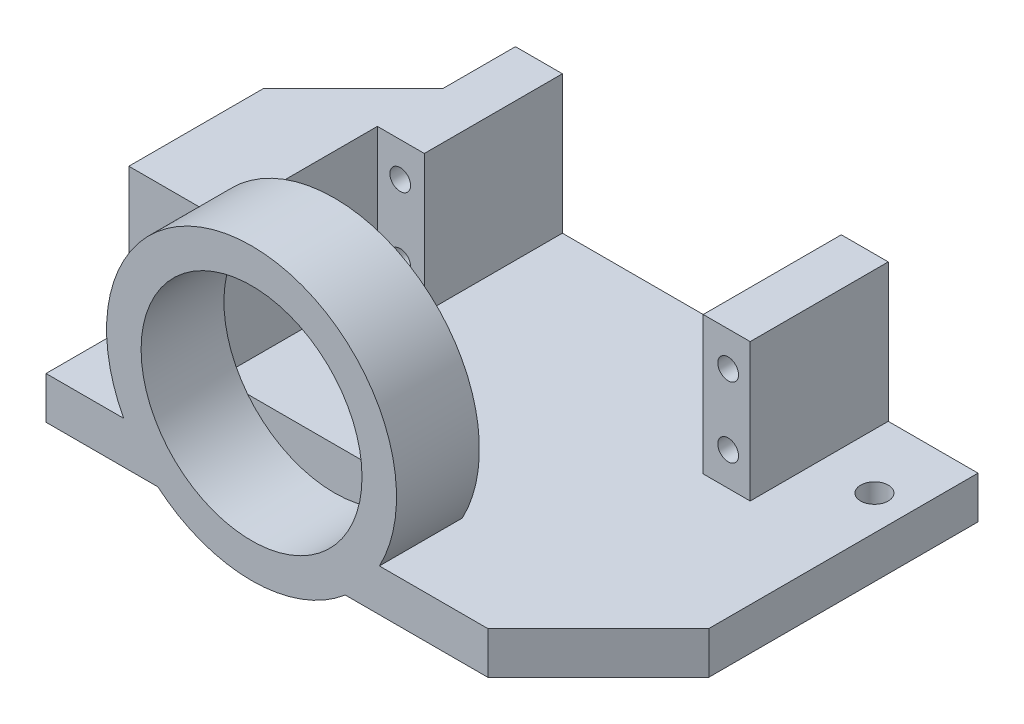
ISO-10303-21;
HEADER;
FILE_DESCRIPTION(('STEP AP214'),'2;1');
FILE_NAME('part.step','',(''),(''),'','','');
FILE_SCHEMA(('AUTOMOTIVE_DESIGN { 1 0 10303 214 1 1 1 1 }'));
ENDSEC;
DATA;
#1=APPLICATION_CONTEXT('core data for automotive mechanical design processes');
#2=APPLICATION_PROTOCOL_DEFINITION('international standard','automotive_design',2000,#1);
#3=PRODUCT_CONTEXT('',#1,'mechanical');
#4=PRODUCT('Part','Part','',(#3));
#5=PRODUCT_RELATED_PRODUCT_CATEGORY('part','',(#4));
#6=PRODUCT_DEFINITION_FORMATION('','',#4);
#7=PRODUCT_DEFINITION_CONTEXT('part definition',#1,'design');
#8=PRODUCT_DEFINITION('design','',#6,#7);
#9=PRODUCT_DEFINITION_SHAPE('','',#8);
#10=(LENGTH_UNIT() NAMED_UNIT(*) SI_UNIT(.MILLI.,.METRE.));
#11=(NAMED_UNIT(*) PLANE_ANGLE_UNIT() SI_UNIT($,.RADIAN.));
#12=(NAMED_UNIT(*) SI_UNIT($,.STERADIAN.) SOLID_ANGLE_UNIT());
#13=UNCERTAINTY_MEASURE_WITH_UNIT(LENGTH_MEASURE(1.E-05),#10,'distance_accuracy_value','');
#14=(GEOMETRIC_REPRESENTATION_CONTEXT(3) GLOBAL_UNCERTAINTY_ASSIGNED_CONTEXT((#13)) GLOBAL_UNIT_ASSIGNED_CONTEXT((#10,
#11,#12)) REPRESENTATION_CONTEXT('',''));
#15=CARTESIAN_POINT('',(0.,0.,0.));
#16=DIRECTION('',(0.,0.,1.));
#17=DIRECTION('',(1.,0.,0.));
#18=AXIS2_PLACEMENT_3D('',#15,#16,#17);
#19=CARTESIAN_POINT('',(0.,6.12,0.));
#20=DIRECTION('',(0.,-1.,0.));
#21=DIRECTION('',(0.,0.,-1.));
#22=AXIS2_PLACEMENT_3D('',#19,#20,#21);
#23=PLANE('',#22);
#24=CARTESIAN_POINT('',(5.,6.12,-10.));
#25=DIRECTION('',(0.,1.,0.));
#26=DIRECTION('',(0.,0.,1.));
#27=AXIS2_PLACEMENT_3D('',#24,#25,#26);
#28=CIRCLE('',#27,2.);
#29=CARTESIAN_POINT('',(5.,6.12,-8.));
#30=VERTEX_POINT('',#29);
#31=EDGE_CURVE('E232',#30,#30,#28,.T.);
#32=ORIENTED_EDGE('',*,*,#31,.F.);
#33=EDGE_LOOP('',(#32));
#34=FACE_BOUND('',#33,.T.);
#35=DIRECTION('',(0.,0.,1.));
#36=VECTOR('',#35,1.);
#37=CARTESIAN_POINT('',(0.,6.12,0.));
#38=LINE('',#37,#36);
#39=CARTESIAN_POINT('',(0.,6.12,-20.));
#40=VERTEX_POINT('',#39);
#41=CARTESIAN_POINT('',(0.,6.12,3.50000000000001));
#42=VERTEX_POINT('',#41);
#43=EDGE_CURVE('E224',#40,#42,#38,.T.);
#44=ORIENTED_EDGE('',*,*,#43,.T.);
#45=DIRECTION('',(-0.707106781186549,0.,0.707106781186546));
#46=VECTOR('',#45,1.);
#47=CARTESIAN_POINT('',(1.75,6.12,1.75000000000001));
#48=LINE('',#47,#46);
#49=CARTESIAN_POINT('',(6.49999999999997,6.12,-3.));
#50=VERTEX_POINT('',#49);
#51=EDGE_CURVE('E51',#42,#50,#48,.F.);
#52=ORIENTED_EDGE('',*,*,#51,.T.);
#53=DIRECTION('',(-0.707106781186551,0.,0.707106781186544));
#54=VECTOR('',#53,1.);
#55=CARTESIAN_POINT('',(6.49999999999997,6.12,-3.));
#56=LINE('',#55,#54);
#57=CARTESIAN_POINT('',(13.,6.12,-9.49999999999996));
#58=VERTEX_POINT('',#57);
#59=EDGE_CURVE('E58',#50,#58,#56,.F.);
#60=ORIENTED_EDGE('',*,*,#59,.T.);
#61=DIRECTION('',(0.,0.,1.));
#62=VECTOR('',#61,1.);
#63=CARTESIAN_POINT('',(13.,6.12,0.));
#64=LINE('',#63,#62);
#65=CARTESIAN_POINT('',(13.,6.12,-20.));
#66=VERTEX_POINT('',#65);
#67=EDGE_CURVE('E280',#66,#58,#64,.T.);
#68=ORIENTED_EDGE('',*,*,#67,.F.);
#69=DIRECTION('',(-1.,0.,0.));
#70=VECTOR('',#69,1.);
#71=CARTESIAN_POINT('',(0.,6.12,-20.));
#72=LINE('',#71,#70);
#73=EDGE_CURVE('E235',#66,#40,#72,.T.);
#74=ORIENTED_EDGE('',*,*,#73,.T.);
#75=EDGE_LOOP('',(#44,#52,#60,#68,#74));
#76=FACE_BOUND('',#75,.T.);
#77=ADVANCED_FACE('F41',(#34,#76),#23,.F.);
#78=DIRECTION('',(0.,0.,1.));
#79=VECTOR('',#78,1.);
#80=CARTESIAN_POINT('',(11.2572193942898,6.12,23.));
#81=LINE('',#80,#79);
#82=CARTESIAN_POINT('',(11.2572193942898,6.12,35.));
#83=VERTEX_POINT('',#82);
#84=CARTESIAN_POINT('',(11.2572193942898,6.12,23.));
#85=VERTEX_POINT('',#84);
#86=EDGE_CURVE('E217',#83,#85,#81,.F.);
#87=ORIENTED_EDGE('',*,*,#86,.T.);
#88=DIRECTION('',(-1.,0.,0.));
#89=VECTOR('',#88,1.);
#90=CARTESIAN_POINT('',(13.,6.12,23.));
#91=LINE('',#90,#89);
#92=CARTESIAN_POINT('',(0.,6.12,23.));
#93=VERTEX_POINT('',#92);
#94=EDGE_CURVE('E200',#85,#93,#91,.T.);
#95=ORIENTED_EDGE('',*,*,#94,.T.);
#96=CARTESIAN_POINT('',(0.,6.12,35.));
#97=VERTEX_POINT('',#96);
#98=EDGE_CURVE('E214',#93,#97,#38,.T.);
#99=ORIENTED_EDGE('',*,*,#98,.T.);
#100=DIRECTION('',(-1.,0.,0.));
#101=VECTOR('',#100,1.);
#102=CARTESIAN_POINT('',(0.,6.12,35.));
#103=LINE('',#102,#101);
#104=EDGE_CURVE('E391',#83,#97,#103,.T.);
#105=ORIENTED_EDGE('',*,*,#104,.F.);
#106=EDGE_LOOP('',(#87,#95,#99,#105));
#107=FACE_BOUND('',#106,.T.);
#108=ADVANCED_FACE('F212',(#107),#23,.F.);
#109=CARTESIAN_POINT('',(13.,26.12,0.));
#110=DIRECTION('',(1.,0.,0.));
#111=DIRECTION('',(0.,0.,-1.));
#112=AXIS2_PLACEMENT_3D('',#109,#110,#111);
#113=PLANE('',#112);
#114=ORIENTED_EDGE('',*,*,#67,.T.);
#115=DIRECTION('',(0.,1.,0.));
#116=VECTOR('',#115,1.);
#117=CARTESIAN_POINT('',(13.,26.12,-9.49999999999996));
#118=LINE('',#117,#116);
#119=CARTESIAN_POINT('',(13.,26.12,-9.49999999999996));
#120=VERTEX_POINT('',#119);
#121=EDGE_CURVE('E271',#58,#120,#118,.T.);
#122=ORIENTED_EDGE('',*,*,#121,.T.);
#123=DIRECTION('',(0.,0.,1.));
#124=VECTOR('',#123,1.);
#125=CARTESIAN_POINT('',(13.,26.12,0.));
#126=LINE('',#125,#124);
#127=CARTESIAN_POINT('',(13.,26.12,-20.));
#128=VERTEX_POINT('',#127);
#129=EDGE_CURVE('E279',#128,#120,#126,.T.);
#130=ORIENTED_EDGE('',*,*,#129,.F.);
#131=DIRECTION('',(0.,-1.,0.));
#132=VECTOR('',#131,1.);
#133=CARTESIAN_POINT('',(13.,26.12,-20.));
#134=LINE('',#133,#132);
#135=EDGE_CURVE('E415',#128,#66,#134,.T.);
#136=ORIENTED_EDGE('',*,*,#135,.T.);
#137=EDGE_LOOP('',(#114,#122,#130,#136));
#138=FACE_BOUND('',#137,.T.);
#139=ADVANCED_FACE('F277',(#138),#113,.F.);
#140=CARTESIAN_POINT('',(0.,6.12,0.));
#141=DIRECTION('',(0.,0.,-1.));
#142=DIRECTION('',(-1.,0.,0.));
#143=AXIS2_PLACEMENT_3D('',#140,#141,#142);
#144=PLANE('',#143);
#145=CARTESIAN_POINT('',(63.81,10.946,0.));
#146=DIRECTION('',(0.,0.,1.));
#147=DIRECTION('',(1.,0.,0.));
#148=AXIS2_PLACEMENT_3D('',#145,#146,#147);
#149=CIRCLE('',#148,1.5);
#150=CARTESIAN_POINT('',(65.31,10.946,0.));
#151=VERTEX_POINT('',#150);
#152=EDGE_CURVE('E345',#151,#151,#149,.T.);
#153=ORIENTED_EDGE('',*,*,#152,.F.);
#154=EDGE_LOOP('',(#153));
#155=FACE_BOUND('',#154,.T.);
#156=CARTESIAN_POINT('',(63.81,21.106,0.));
#157=DIRECTION('',(0.,0.,1.));
#158=DIRECTION('',(1.,0.,0.));
#159=AXIS2_PLACEMENT_3D('',#156,#157,#158);
#160=CIRCLE('',#159,1.5);
#161=CARTESIAN_POINT('',(65.31,21.106,0.));
#162=VERTEX_POINT('',#161);
#163=EDGE_CURVE('E334',#162,#162,#160,.T.);
#164=ORIENTED_EDGE('',*,*,#163,.F.);
#165=EDGE_LOOP('',(#164));
#166=FACE_BOUND('',#165,.T.);
#167=DIRECTION('',(0.,1.,0.));
#168=VECTOR('',#167,1.);
#169=CARTESIAN_POINT('',(60.2,-38.9594853564235,0.));
#170=LINE('',#169,#168);
#171=CARTESIAN_POINT('',(60.2,6.12,0.));
#172=VERTEX_POINT('',#171);
#173=CARTESIAN_POINT('',(60.2,26.12,0.));
#174=VERTEX_POINT('',#173);
#175=EDGE_CURVE('E323',#172,#174,#170,.T.);
#176=ORIENTED_EDGE('',*,*,#175,.F.);
#177=DIRECTION('',(-1.,0.,0.));
#178=VECTOR('',#177,1.);
#179=CARTESIAN_POINT('',(0.,6.12,0.));
#180=LINE('',#179,#178);
#181=CARTESIAN_POINT('',(67.,6.12,0.));
#182=VERTEX_POINT('',#181);
#183=EDGE_CURVE('E260',#182,#172,#180,.T.);
#184=ORIENTED_EDGE('',*,*,#183,.F.);
#185=DIRECTION('',(0.,-1.,0.));
#186=VECTOR('',#185,1.);
#187=CARTESIAN_POINT('',(67.,26.12,0.));
#188=LINE('',#187,#186);
#189=CARTESIAN_POINT('',(67.,26.12,0.));
#190=VERTEX_POINT('',#189);
#191=EDGE_CURVE('E409',#190,#182,#188,.T.);
#192=ORIENTED_EDGE('',*,*,#191,.F.);
#193=DIRECTION('',(1.,0.,0.));
#194=VECTOR('',#193,1.);
#195=CARTESIAN_POINT('',(60.,26.12,0.));
#196=LINE('',#195,#194);
#197=EDGE_CURVE('E397',#174,#190,#196,.T.);
#198=ORIENTED_EDGE('',*,*,#197,.F.);
#199=EDGE_LOOP('',(#176,#184,#192,#198));
#200=FACE_BOUND('',#199,.T.);
#201=ADVANCED_FACE('F553',(#155,#166,#200),#144,.F.);
#202=CARTESIAN_POINT('',(0.,26.12,0.));
#203=DIRECTION('',(0.,-1.,0.));
#204=DIRECTION('',(0.,0.,-1.));
#205=AXIS2_PLACEMENT_3D('',#202,#203,#204);
#206=PLANE('',#205);
#207=DIRECTION('',(0.,0.,1.));
#208=VECTOR('',#207,1.);
#209=CARTESIAN_POINT('',(60.2,26.12,-20.));
#210=LINE('',#209,#208);
#211=CARTESIAN_POINT('',(60.2,26.12,-20.));
#212=VERTEX_POINT('',#211);
#213=EDGE_CURVE('E312',#212,#174,#210,.T.);
#214=ORIENTED_EDGE('',*,*,#213,.T.);
#215=ORIENTED_EDGE('',*,*,#197,.T.);
#216=DIRECTION('',(0.,0.,-1.));
#217=VECTOR('',#216,1.);
#218=CARTESIAN_POINT('',(67.,26.12,0.));
#219=LINE('',#218,#217);
#220=CARTESIAN_POINT('',(67.,26.12,-20.));
#221=VERTEX_POINT('',#220);
#222=EDGE_CURVE('E399',#190,#221,#219,.T.);
#223=ORIENTED_EDGE('',*,*,#222,.T.);
#224=DIRECTION('',(-1.,0.,0.));
#225=VECTOR('',#224,1.);
#226=CARTESIAN_POINT('',(60.,26.12,-20.));
#227=LINE('',#226,#225);
#228=EDGE_CURVE('E401',#221,#212,#227,.T.);
#229=ORIENTED_EDGE('',*,*,#228,.T.);
#230=EDGE_LOOP('',(#214,#215,#223,#229));
#231=FACE_BOUND('',#230,.T.);
#232=ADVANCED_FACE('F550',(#231),#206,.F.);
#233=CARTESIAN_POINT('',(16.312,10.946,0.));
#234=DIRECTION('',(0.,0.,1.));
#235=DIRECTION('',(1.,0.,0.));
#236=AXIS2_PLACEMENT_3D('',#233,#234,#235);
#237=CIRCLE('',#236,1.5);
#238=CARTESIAN_POINT('',(17.812,10.946,0.));
#239=VERTEX_POINT('',#238);
#240=EDGE_CURVE('E339',#239,#239,#237,.T.);
#241=ORIENTED_EDGE('',*,*,#240,.F.);
#242=EDGE_LOOP('',(#241));
#243=FACE_BOUND('',#242,.T.);
#244=CARTESIAN_POINT('',(16.312,21.106,0.));
#245=DIRECTION('',(0.,0.,1.));
#246=DIRECTION('',(1.,0.,0.));
#247=AXIS2_PLACEMENT_3D('',#244,#245,#246);
#248=CIRCLE('',#247,1.5);
#249=CARTESIAN_POINT('',(17.812,21.106,0.));
#250=VERTEX_POINT('',#249);
#251=EDGE_CURVE('E338',#250,#250,#248,.T.);
#252=ORIENTED_EDGE('',*,*,#251,.F.);
#253=EDGE_LOOP('',(#252));
#254=FACE_BOUND('',#253,.T.);
#255=CARTESIAN_POINT('',(19.8,6.12,0.));
#256=VERTEX_POINT('',#255);
#257=CARTESIAN_POINT('',(13.,6.12,0.));
#258=VERTEX_POINT('',#257);
#259=EDGE_CURVE('E249',#256,#258,#180,.T.);
#260=ORIENTED_EDGE('',*,*,#259,.F.);
#261=DIRECTION('',(0.,1.,0.));
#262=VECTOR('',#261,1.);
#263=CARTESIAN_POINT('',(19.8,-38.9594853564235,0.));
#264=LINE('',#263,#262);
#265=CARTESIAN_POINT('',(19.8,26.12,0.));
#266=VERTEX_POINT('',#265);
#267=EDGE_CURVE('E319',#256,#266,#264,.T.);
#268=ORIENTED_EDGE('',*,*,#267,.T.);
#269=DIRECTION('',(1.,0.,0.));
#270=VECTOR('',#269,1.);
#271=CARTESIAN_POINT('',(13.,26.12,0.));
#272=LINE('',#271,#270);
#273=CARTESIAN_POINT('',(13.,26.12,0.));
#274=VERTEX_POINT('',#273);
#275=EDGE_CURVE('E290',#274,#266,#272,.T.);
#276=ORIENTED_EDGE('',*,*,#275,.F.);
#277=DIRECTION('',(0.,-1.,0.));
#278=VECTOR('',#277,1.);
#279=CARTESIAN_POINT('',(13.,26.12,0.));
#280=LINE('',#279,#278);
#281=EDGE_CURVE('E418',#274,#258,#280,.T.);
#282=ORIENTED_EDGE('',*,*,#281,.T.);
#283=EDGE_LOOP('',(#260,#268,#276,#282));
#284=FACE_BOUND('',#283,.T.);
#285=ADVANCED_FACE('F479',(#243,#254,#284),#144,.F.);
#286=ORIENTED_EDGE('',*,*,#259,.T.);
#287=DIRECTION('',(0.,0.,1.));
#288=VECTOR('',#287,1.);
#289=CARTESIAN_POINT('',(13.,6.12,-3.));
#290=LINE('',#289,#288);
#291=CARTESIAN_POINT('',(13.,6.12,23.));
#292=VERTEX_POINT('',#291);
#293=EDGE_CURVE('E218',#258,#292,#290,.T.);
#294=ORIENTED_EDGE('',*,*,#293,.T.);
#295=DIRECTION('',(-1.,0.,0.));
#296=VECTOR('',#295,1.);
#297=CARTESIAN_POINT('',(0.,6.12,23.));
#298=LINE('',#297,#296);
#299=CARTESIAN_POINT('',(17.20932077608,6.12,23.));
#300=VERTEX_POINT('',#299);
#301=EDGE_CURVE('E381',#300,#292,#298,.T.);
#302=ORIENTED_EDGE('',*,*,#301,.F.);
#303=CARTESIAN_POINT('',(42.3386792239201,6.12,23.));
#304=VERTEX_POINT('',#303);
#305=EDGE_CURVE('E385',#304,#300,#298,.T.);
#306=ORIENTED_EDGE('',*,*,#305,.F.);
#307=CARTESIAN_POINT('',(48.2907806057103,6.12,23.));
#308=VERTEX_POINT('',#307);
#309=EDGE_CURVE('E382',#308,#304,#298,.T.);
#310=ORIENTED_EDGE('',*,*,#309,.F.);
#311=DIRECTION('',(0.,0.,1.));
#312=VECTOR('',#311,1.);
#313=CARTESIAN_POINT('',(48.2907806057103,6.12,23.));
#314=LINE('',#313,#312);
#315=CARTESIAN_POINT('',(48.2907806057103,6.12,35.));
#316=VERTEX_POINT('',#315);
#317=EDGE_CURVE('E378',#308,#316,#314,.T.);
#318=ORIENTED_EDGE('',*,*,#317,.T.);
#319=CARTESIAN_POINT('',(64.,6.12,35.));
#320=VERTEX_POINT('',#319);
#321=EDGE_CURVE('E392',#320,#316,#103,.T.);
#322=ORIENTED_EDGE('',*,*,#321,.F.);
#323=DIRECTION('',(-0.707106781186548,0.,0.707106781186548));
#324=VECTOR('',#323,1.);
#325=CARTESIAN_POINT('',(80.,6.12,19.));
#326=LINE('',#325,#324);
#327=CARTESIAN_POINT('',(80.,6.12,19.));
#328=VERTEX_POINT('',#327);
#329=EDGE_CURVE('E328',#328,#320,#326,.T.);
#330=ORIENTED_EDGE('',*,*,#329,.F.);
#331=DIRECTION('',(0.,0.,-1.));
#332=VECTOR('',#331,1.);
#333=CARTESIAN_POINT('',(80.,6.12,0.));
#334=LINE('',#333,#332);
#335=CARTESIAN_POINT('',(80.,6.12,-20.));
#336=VERTEX_POINT('',#335);
#337=EDGE_CURVE('E227',#328,#336,#334,.T.);
#338=ORIENTED_EDGE('',*,*,#337,.T.);
#339=CARTESIAN_POINT('',(67.,6.12,-20.));
#340=VERTEX_POINT('',#339);
#341=EDGE_CURVE('E236',#336,#340,#72,.T.);
#342=ORIENTED_EDGE('',*,*,#341,.T.);
#343=DIRECTION('',(0.,0.,-1.));
#344=VECTOR('',#343,1.);
#345=CARTESIAN_POINT('',(67.,6.12,0.));
#346=LINE('',#345,#344);
#347=EDGE_CURVE('E394',#182,#340,#346,.T.);
#348=ORIENTED_EDGE('',*,*,#347,.F.);
#349=ORIENTED_EDGE('',*,*,#183,.T.);
#350=DIRECTION('',(0.,0.,1.));
#351=VECTOR('',#350,1.);
#352=CARTESIAN_POINT('',(60.2,6.12,-20.));
#353=LINE('',#352,#351);
#354=CARTESIAN_POINT('',(60.2,6.12,-20.));
#355=VERTEX_POINT('',#354);
#356=EDGE_CURVE('E302',#355,#172,#353,.T.);
#357=ORIENTED_EDGE('',*,*,#356,.F.);
#358=CARTESIAN_POINT('',(19.8,6.12,-20.));
#359=VERTEX_POINT('',#358);
#360=EDGE_CURVE('E239',#355,#359,#72,.T.);
#361=ORIENTED_EDGE('',*,*,#360,.T.);
#362=DIRECTION('',(0.,0.,1.));
#363=VECTOR('',#362,1.);
#364=CARTESIAN_POINT('',(19.8,6.12,-20.));
#365=LINE('',#364,#363);
#366=EDGE_CURVE('E311',#359,#256,#365,.T.);
#367=ORIENTED_EDGE('',*,*,#366,.T.);
#368=EDGE_LOOP('',(#286,#294,#302,#306,#310,#318,#322,#330,#338,#342,#348,#349,#357,#361,#367));
#369=FACE_BOUND('',#368,.T.);
#370=CARTESIAN_POINT('',(75.,6.12,-10.));
#371=DIRECTION('',(0.,1.,0.));
#372=DIRECTION('',(0.,0.,1.));
#373=AXIS2_PLACEMENT_3D('',#370,#371,#372);
#374=CIRCLE('',#373,2.);
#375=CARTESIAN_POINT('',(75.,6.12,-8.));
#376=VERTEX_POINT('',#375);
#377=EDGE_CURVE('E253',#376,#376,#374,.T.);
#378=ORIENTED_EDGE('',*,*,#377,.F.);
#379=EDGE_LOOP('',(#378));
#380=FACE_BOUND('',#379,.T.);
#381=ADVANCED_FACE('F430',(#369,#380),#23,.F.);
#382=CARTESIAN_POINT('',(0.,6.12,0.));
#383=DIRECTION('',(1.,0.,0.));
#384=DIRECTION('',(0.,0.,-1.));
#385=AXIS2_PLACEMENT_3D('',#382,#383,#384);
#386=PLANE('',#385);
#387=DIRECTION('',(0.,0.,-1.));
#388=VECTOR('',#387,1.);
#389=CARTESIAN_POINT('',(0.,26.12,-3.));
#390=LINE('',#389,#388);
#391=CARTESIAN_POINT('',(0.,26.12,23.));
#392=VERTEX_POINT('',#391);
#393=CARTESIAN_POINT('',(0.,26.12,3.50000000000001));
#394=VERTEX_POINT('',#393);
#395=EDGE_CURVE('E297',#392,#394,#390,.T.);
#396=ORIENTED_EDGE('',*,*,#395,.T.);
#397=DIRECTION('',(0.,-1.,0.));
#398=VECTOR('',#397,1.);
#399=CARTESIAN_POINT('',(0.,6.12,3.50000000000001));
#400=LINE('',#399,#398);
#401=EDGE_CURVE('E265',#394,#42,#400,.T.);
#402=ORIENTED_EDGE('',*,*,#401,.T.);
#403=ORIENTED_EDGE('',*,*,#43,.F.);
#404=DIRECTION('',(0.,-1.,0.));
#405=VECTOR('',#404,1.);
#406=CARTESIAN_POINT('',(0.,6.12,-20.));
#407=LINE('',#406,#405);
#408=CARTESIAN_POINT('',(0.,0.,-20.));
#409=VERTEX_POINT('',#408);
#410=EDGE_CURVE('E238',#40,#409,#407,.T.);
#411=ORIENTED_EDGE('',*,*,#410,.T.);
#412=DIRECTION('',(0.,0.,1.));
#413=VECTOR('',#412,1.);
#414=CARTESIAN_POINT('',(0.,0.,0.));
#415=LINE('',#414,#413);
#416=CARTESIAN_POINT('',(0.,0.,35.));
#417=VERTEX_POINT('',#416);
#418=EDGE_CURVE('E240',#409,#417,#415,.T.);
#419=ORIENTED_EDGE('',*,*,#418,.T.);
#420=DIRECTION('',(0.,-1.,0.));
#421=VECTOR('',#420,1.);
#422=CARTESIAN_POINT('',(0.,6.12,35.));
#423=LINE('',#422,#421);
#424=EDGE_CURVE('E223',#97,#417,#423,.T.);
#425=ORIENTED_EDGE('',*,*,#424,.F.);
#426=ORIENTED_EDGE('',*,*,#98,.F.);
#427=DIRECTION('',(0.,-1.,0.));
#428=VECTOR('',#427,1.);
#429=CARTESIAN_POINT('',(0.,55.1888837074973,23.));
#430=LINE('',#429,#428);
#431=EDGE_CURVE('E197',#392,#93,#430,.T.);
#432=ORIENTED_EDGE('',*,*,#431,.F.);
#433=EDGE_LOOP('',(#396,#402,#403,#411,#419,#425,#426,#432));
#434=FACE_BOUND('',#433,.T.);
#435=ADVANCED_FACE('F221',(#434),#386,.F.);
#436=CARTESIAN_POINT('',(80.,6.12,0.));
#437=DIRECTION('',(-1.,0.,0.));
#438=DIRECTION('',(0.,0.,1.));
#439=AXIS2_PLACEMENT_3D('',#436,#437,#438);
#440=PLANE('',#439);
#441=ORIENTED_EDGE('',*,*,#337,.F.);
#442=DIRECTION('',(0.,1.,0.));
#443=VECTOR('',#442,1.);
#444=CARTESIAN_POINT('',(80.,-3.88,19.));
#445=LINE('',#444,#443);
#446=CARTESIAN_POINT('',(80.,0.,19.));
#447=VERTEX_POINT('',#446);
#448=EDGE_CURVE('E330',#447,#328,#445,.T.);
#449=ORIENTED_EDGE('',*,*,#448,.F.);
#450=DIRECTION('',(0.,0.,-1.));
#451=VECTOR('',#450,1.);
#452=CARTESIAN_POINT('',(80.,0.,0.));
#453=LINE('',#452,#451);
#454=CARTESIAN_POINT('',(80.,0.,-20.));
#455=VERTEX_POINT('',#454);
#456=EDGE_CURVE('E228',#447,#455,#453,.T.);
#457=ORIENTED_EDGE('',*,*,#456,.T.);
#458=DIRECTION('',(0.,-1.,0.));
#459=VECTOR('',#458,1.);
#460=CARTESIAN_POINT('',(80.,6.12,-20.));
#461=LINE('',#460,#459);
#462=EDGE_CURVE('E246',#336,#455,#461,.T.);
#463=ORIENTED_EDGE('',*,*,#462,.F.);
#464=EDGE_LOOP('',(#441,#449,#457,#463));
#465=FACE_BOUND('',#464,.T.);
#466=ADVANCED_FACE('F574',(#465),#440,.F.);
#467=CARTESIAN_POINT('',(0.,6.12,-20.));
#468=DIRECTION('',(0.,0.,1.));
#469=DIRECTION('',(1.,0.,0.));
#470=AXIS2_PLACEMENT_3D('',#467,#468,#469);
#471=PLANE('',#470);
#472=DIRECTION('',(0.,1.,0.));
#473=VECTOR('',#472,1.);
#474=CARTESIAN_POINT('',(19.8,-38.9594853564235,-20.));
#475=LINE('',#474,#473);
#476=CARTESIAN_POINT('',(19.8,26.12,-20.));
#477=VERTEX_POINT('',#476);
#478=EDGE_CURVE('E315',#359,#477,#475,.T.);
#479=ORIENTED_EDGE('',*,*,#478,.F.);
#480=ORIENTED_EDGE('',*,*,#360,.F.);
#481=DIRECTION('',(0.,1.,0.));
#482=VECTOR('',#481,1.);
#483=CARTESIAN_POINT('',(60.2,-38.9594853564235,-20.));
#484=LINE('',#483,#482);
#485=EDGE_CURVE('E316',#355,#212,#484,.T.);
#486=ORIENTED_EDGE('',*,*,#485,.T.);
#487=ORIENTED_EDGE('',*,*,#228,.F.);
#488=DIRECTION('',(0.,-1.,0.));
#489=VECTOR('',#488,1.);
#490=CARTESIAN_POINT('',(67.,26.12,-20.));
#491=LINE('',#490,#489);
#492=EDGE_CURVE('E404',#221,#340,#491,.T.);
#493=ORIENTED_EDGE('',*,*,#492,.T.);
#494=ORIENTED_EDGE('',*,*,#341,.F.);
#495=ORIENTED_EDGE('',*,*,#462,.T.);
#496=DIRECTION('',(-1.,0.,0.));
#497=VECTOR('',#496,1.);
#498=CARTESIAN_POINT('',(0.,0.,-20.));
#499=LINE('',#498,#497);
#500=EDGE_CURVE('E225',#455,#409,#499,.T.);
#501=ORIENTED_EDGE('',*,*,#500,.T.);
#502=ORIENTED_EDGE('',*,*,#410,.F.);
#503=ORIENTED_EDGE('',*,*,#73,.F.);
#504=ORIENTED_EDGE('',*,*,#135,.F.);
#505=DIRECTION('',(-1.,0.,0.));
#506=VECTOR('',#505,1.);
#507=CARTESIAN_POINT('',(13.,26.12,-20.));
#508=LINE('',#507,#506);
#509=EDGE_CURVE('E288',#477,#128,#508,.T.);
#510=ORIENTED_EDGE('',*,*,#509,.F.);
#511=EDGE_LOOP('',(#479,#480,#486,#487,#493,#494,#495,#501,#502,#503,#504,#510));
#512=FACE_BOUND('',#511,.T.);
#513=ADVANCED_FACE('F482',(#512),#471,.F.);
#514=CARTESIAN_POINT('',(0.,0.,0.));
#515=DIRECTION('',(0.,-1.,0.));
#516=DIRECTION('',(0.,0.,-1.));
#517=AXIS2_PLACEMENT_3D('',#514,#515,#516);
#518=PLANE('',#517);
#519=DIRECTION('',(0.707106781186548,0.,-0.707106781186548));
#520=VECTOR('',#519,1.);
#521=CARTESIAN_POINT('',(49.5,0.,49.5));
#522=LINE('',#521,#520);
#523=CARTESIAN_POINT('',(64.,0.,35.));
#524=VERTEX_POINT('',#523);
#525=EDGE_CURVE('E332',#524,#447,#522,.T.);
#526=ORIENTED_EDGE('',*,*,#525,.F.);
#527=DIRECTION('',(1.,0.,0.));
#528=VECTOR('',#527,1.);
#529=CARTESIAN_POINT('',(0.,0.,35.));
#530=LINE('',#529,#528);
#531=CARTESIAN_POINT('',(43.3448262091891,0.,35.));
#532=VERTEX_POINT('',#531);
#533=EDGE_CURVE('E387',#532,#524,#530,.T.);
#534=ORIENTED_EDGE('',*,*,#533,.F.);
#535=DIRECTION('',(0.,0.,1.));
#536=VECTOR('',#535,1.);
#537=CARTESIAN_POINT('',(43.3448262091891,0.,23.));
#538=LINE('',#537,#536);
#539=CARTESIAN_POINT('',(43.3448262091891,0.,23.));
#540=VERTEX_POINT('',#539);
#541=EDGE_CURVE('E374',#540,#532,#538,.T.);
#542=ORIENTED_EDGE('',*,*,#541,.F.);
#543=DIRECTION('',(-1.,0.,0.));
#544=VECTOR('',#543,1.);
#545=CARTESIAN_POINT('',(0.,0.,23.));
#546=LINE('',#545,#544);
#547=CARTESIAN_POINT('',(16.2031737908109,0.,23.));
#548=VERTEX_POINT('',#547);
#549=EDGE_CURVE('E256',#540,#548,#546,.T.);
#550=ORIENTED_EDGE('',*,*,#549,.T.);
#551=DIRECTION('',(0.,0.,1.));
#552=VECTOR('',#551,1.);
#553=CARTESIAN_POINT('',(16.2031737908109,0.,23.));
#554=LINE('',#553,#552);
#555=CARTESIAN_POINT('',(16.2031737908109,0.,35.));
#556=VERTEX_POINT('',#555);
#557=EDGE_CURVE('E372',#556,#548,#554,.F.);
#558=ORIENTED_EDGE('',*,*,#557,.F.);
#559=EDGE_CURVE('E388',#417,#556,#530,.T.);
#560=ORIENTED_EDGE('',*,*,#559,.F.);
#561=ORIENTED_EDGE('',*,*,#418,.F.);
#562=ORIENTED_EDGE('',*,*,#500,.F.);
#563=ORIENTED_EDGE('',*,*,#456,.F.);
#564=EDGE_LOOP('',(#526,#534,#542,#550,#558,#560,#561,#562,#563));
#565=FACE_BOUND('',#564,.T.);
#566=CARTESIAN_POINT('',(75.,0.,-10.));
#567=DIRECTION('',(0.,-1.,0.));
#568=DIRECTION('',(0.,0.,-1.));
#569=AXIS2_PLACEMENT_3D('',#566,#567,#568);
#570=CIRCLE('',#569,2.);
#571=CARTESIAN_POINT('',(75.,0.,-12.));
#572=VERTEX_POINT('',#571);
#573=EDGE_CURVE('E242',#572,#572,#570,.T.);
#574=ORIENTED_EDGE('',*,*,#573,.F.);
#575=EDGE_LOOP('',(#574));
#576=FACE_BOUND('',#575,.T.);
#577=CARTESIAN_POINT('',(5.,0.,-10.));
#578=DIRECTION('',(0.,-1.,0.));
#579=DIRECTION('',(0.,0.,-1.));
#580=AXIS2_PLACEMENT_3D('',#577,#578,#579);
#581=CIRCLE('',#580,2.);
#582=CARTESIAN_POINT('',(5.,0.,-12.));
#583=VERTEX_POINT('',#582);
#584=EDGE_CURVE('E250',#583,#583,#581,.T.);
#585=ORIENTED_EDGE('',*,*,#584,.F.);
#586=EDGE_LOOP('',(#585));
#587=FACE_BOUND('',#586,.T.);
#588=ADVANCED_FACE('F439',(#565,#576,#587),#518,.T.);
#589=CARTESIAN_POINT('',(5.,-16.8,-10.));
#590=DIRECTION('',(0.,1.,0.));
#591=DIRECTION('',(0.,0.,1.));
#592=AXIS2_PLACEMENT_3D('',#589,#590,#591);
#593=CYLINDRICAL_SURFACE('',#592,2.);
#594=ORIENTED_EDGE('',*,*,#584,.T.);
#595=EDGE_LOOP('',(#594));
#596=FACE_BOUND('',#595,.T.);
#597=ORIENTED_EDGE('',*,*,#31,.T.);
#598=EDGE_LOOP('',(#597));
#599=FACE_BOUND('',#598,.T.);
#600=ADVANCED_FACE('F426',(#596,#599),#593,.F.);
#601=CARTESIAN_POINT('',(75.,-16.8,-10.));
#602=DIRECTION('',(0.,1.,0.));
#603=DIRECTION('',(0.,0.,1.));
#604=AXIS2_PLACEMENT_3D('',#601,#602,#603);
#605=CYLINDRICAL_SURFACE('',#604,2.);
#606=ORIENTED_EDGE('',*,*,#573,.T.);
#607=EDGE_LOOP('',(#606));
#608=FACE_BOUND('',#607,.T.);
#609=ORIENTED_EDGE('',*,*,#377,.T.);
#610=EDGE_LOOP('',(#609));
#611=FACE_BOUND('',#610,.T.);
#612=ADVANCED_FACE('F560',(#608,#611),#605,.F.);
#613=CARTESIAN_POINT('',(0.,26.12,0.));
#614=DIRECTION('',(0.,-1.,0.));
#615=DIRECTION('',(0.,0.,-1.));
#616=AXIS2_PLACEMENT_3D('',#613,#614,#615);
#617=PLANE('',#616);
#618=ORIENTED_EDGE('',*,*,#129,.T.);
#619=DIRECTION('',(0.707106781186551,0.,-0.707106781186544));
#620=VECTOR('',#619,1.);
#621=CARTESIAN_POINT('',(1.74999999999995,26.12,1.74999999999997));
#622=LINE('',#621,#620);
#623=CARTESIAN_POINT('',(6.50000000000003,26.12,-3.));
#624=VERTEX_POINT('',#623);
#625=EDGE_CURVE('E11',#120,#624,#622,.F.);
#626=ORIENTED_EDGE('',*,*,#625,.T.);
#627=DIRECTION('',(0.707106781186549,0.,-0.707106781186546));
#628=VECTOR('',#627,1.);
#629=CARTESIAN_POINT('',(0.,26.12,3.50000000000001));
#630=LINE('',#629,#628);
#631=EDGE_CURVE('E268',#624,#394,#630,.F.);
#632=ORIENTED_EDGE('',*,*,#631,.T.);
#633=ORIENTED_EDGE('',*,*,#395,.F.);
#634=DIRECTION('',(1.,0.,0.));
#635=VECTOR('',#634,1.);
#636=CARTESIAN_POINT('',(13.,26.12,23.));
#637=LINE('',#636,#635);
#638=CARTESIAN_POINT('',(11.3590288080597,26.12,23.));
#639=VERTEX_POINT('',#638);
#640=EDGE_CURVE('E203',#392,#639,#637,.T.);
#641=ORIENTED_EDGE('',*,*,#640,.T.);
#642=CARTESIAN_POINT('',(13.,26.12,23.));
#643=VERTEX_POINT('',#642);
#644=EDGE_CURVE('E207',#639,#643,#637,.T.);
#645=ORIENTED_EDGE('',*,*,#644,.T.);
#646=DIRECTION('',(0.,0.,-1.));
#647=VECTOR('',#646,1.);
#648=CARTESIAN_POINT('',(13.,26.12,-3.));
#649=LINE('',#648,#647);
#650=EDGE_CURVE('E299',#643,#274,#649,.T.);
#651=ORIENTED_EDGE('',*,*,#650,.T.);
#652=ORIENTED_EDGE('',*,*,#275,.T.);
#653=DIRECTION('',(0.,0.,1.));
#654=VECTOR('',#653,1.);
#655=CARTESIAN_POINT('',(19.8,26.12,-20.));
#656=LINE('',#655,#654);
#657=EDGE_CURVE('E309',#477,#266,#656,.T.);
#658=ORIENTED_EDGE('',*,*,#657,.F.);
#659=ORIENTED_EDGE('',*,*,#509,.T.);
#660=EDGE_LOOP('',(#618,#626,#632,#633,#641,#645,#651,#652,#658,#659));
#661=FACE_BOUND('',#660,.T.);
#662=ADVANCED_FACE('F284',(#661),#617,.F.);
#663=CARTESIAN_POINT('',(67.,26.12,0.));
#664=DIRECTION('',(-1.,0.,0.));
#665=DIRECTION('',(0.,0.,1.));
#666=AXIS2_PLACEMENT_3D('',#663,#664,#665);
#667=PLANE('',#666);
#668=ORIENTED_EDGE('',*,*,#347,.T.);
#669=ORIENTED_EDGE('',*,*,#492,.F.);
#670=ORIENTED_EDGE('',*,*,#222,.F.);
#671=ORIENTED_EDGE('',*,*,#191,.T.);
#672=EDGE_LOOP('',(#668,#669,#670,#671));
#673=FACE_BOUND('',#672,.T.);
#674=ADVANCED_FACE('F549',(#673),#667,.F.);
#675=CARTESIAN_POINT('',(0.,0.,35.));
#676=DIRECTION('',(0.,0.,1.));
#677=DIRECTION('',(1.,0.,0.));
#678=AXIS2_PLACEMENT_3D('',#675,#676,#677);
#679=PLANE('',#678);
#680=DIRECTION('',(0.,-1.,0.));
#681=VECTOR('',#680,1.);
#682=CARTESIAN_POINT('',(64.,0.,35.));
#683=LINE('',#682,#681);
#684=EDGE_CURVE('E263',#320,#524,#683,.T.);
#685=ORIENTED_EDGE('',*,*,#684,.F.);
#686=ORIENTED_EDGE('',*,*,#321,.T.);
#687=CARTESIAN_POINT('',(29.774,16.0259999999996,35.));
#688=DIRECTION('',(0.,0.,1.));
#689=DIRECTION('',(1.,0.,0.));
#690=AXIS2_PLACEMENT_3D('',#687,#688,#689);
#691=CIRCLE('',#690,21.);
#692=EDGE_CURVE('E362',#316,#83,#691,.T.);
#693=ORIENTED_EDGE('',*,*,#692,.T.);
#694=ORIENTED_EDGE('',*,*,#104,.T.);
#695=ORIENTED_EDGE('',*,*,#424,.T.);
#696=ORIENTED_EDGE('',*,*,#559,.T.);
#697=EDGE_CURVE('E371',#556,#532,#691,.T.);
#698=ORIENTED_EDGE('',*,*,#697,.T.);
#699=ORIENTED_EDGE('',*,*,#533,.T.);
#700=EDGE_LOOP('',(#685,#686,#693,#694,#695,#696,#698,#699));
#701=FACE_BOUND('',#700,.T.);
#702=CARTESIAN_POINT('',(29.774,16.0259999999996,35.));
#703=DIRECTION('',(0.,0.,1.));
#704=DIRECTION('',(1.,0.,0.));
#705=AXIS2_PLACEMENT_3D('',#702,#703,#704);
#706=CIRCLE('',#705,16.);
#707=CARTESIAN_POINT('',(45.774,16.0259999999996,35.));
#708=VERTEX_POINT('',#707);
#709=EDGE_CURVE('E356',#708,#708,#706,.T.);
#710=ORIENTED_EDGE('',*,*,#709,.F.);
#711=EDGE_LOOP('',(#710));
#712=FACE_BOUND('',#711,.T.);
#713=ADVANCED_FACE('F445',(#701,#712),#679,.T.);
#714=CARTESIAN_POINT('',(29.774,16.0259999999996,23.));
#715=DIRECTION('',(0.,0.,1.));
#716=DIRECTION('',(1.,0.,0.));
#717=AXIS2_PLACEMENT_3D('',#714,#715,#716);
#718=PLANE('',#717);
#719=ORIENTED_EDGE('',*,*,#549,.F.);
#720=CARTESIAN_POINT('',(29.774,16.0259999999996,23.));
#721=DIRECTION('',(0.,0.,1.));
#722=DIRECTION('',(1.,0.,0.));
#723=AXIS2_PLACEMENT_3D('',#720,#721,#722);
#724=CIRCLE('',#723,21.);
#725=EDGE_CURVE('E368',#548,#540,#724,.T.);
#726=ORIENTED_EDGE('',*,*,#725,.F.);
#727=EDGE_LOOP('',(#719,#726));
#728=FACE_BOUND('',#727,.T.);
#729=ADVANCED_FACE('F542',(#728),#718,.F.);
#730=CARTESIAN_POINT('',(29.774,16.0259999999996,23.));
#731=DIRECTION('',(0.,0.,1.));
#732=DIRECTION('',(1.,0.,0.));
#733=AXIS2_PLACEMENT_3D('',#730,#731,#732);
#734=CYLINDRICAL_SURFACE('',#733,21.);
#735=ORIENTED_EDGE('',*,*,#725,.T.);
#736=ORIENTED_EDGE('',*,*,#541,.T.);
#737=ORIENTED_EDGE('',*,*,#697,.F.);
#738=ORIENTED_EDGE('',*,*,#557,.T.);
#739=EDGE_LOOP('',(#735,#736,#737,#738));
#740=FACE_BOUND('',#739,.T.);
#741=ADVANCED_FACE('F456',(#740),#734,.T.);
#742=ORIENTED_EDGE('',*,*,#301,.T.);
#743=DIRECTION('',(0.,-1.,0.));
#744=VECTOR('',#743,1.);
#745=CARTESIAN_POINT('',(13.,55.1888837074973,23.));
#746=LINE('',#745,#744);
#747=EDGE_CURVE('E208',#643,#292,#746,.T.);
#748=ORIENTED_EDGE('',*,*,#747,.F.);
#749=ORIENTED_EDGE('',*,*,#644,.F.);
#750=EDGE_CURVE('E365',#308,#639,#724,.T.);
#751=ORIENTED_EDGE('',*,*,#750,.F.);
#752=ORIENTED_EDGE('',*,*,#309,.T.);
#753=CARTESIAN_POINT('',(29.774,16.0259999999996,23.));
#754=DIRECTION('',(0.,0.,1.));
#755=DIRECTION('',(1.,0.,0.));
#756=AXIS2_PLACEMENT_3D('',#753,#754,#755);
#757=CIRCLE('',#756,16.);
#758=EDGE_CURVE('E259',#304,#300,#757,.T.);
#759=ORIENTED_EDGE('',*,*,#758,.T.);
#760=EDGE_LOOP('',(#742,#748,#749,#751,#752,#759));
#761=FACE_BOUND('',#760,.T.);
#762=ADVANCED_FACE('F471',(#761),#718,.F.);
#763=ORIENTED_EDGE('',*,*,#317,.F.);
#764=ORIENTED_EDGE('',*,*,#750,.T.);
#765=EDGE_CURVE('E369',#639,#85,#724,.T.);
#766=ORIENTED_EDGE('',*,*,#765,.T.);
#767=ORIENTED_EDGE('',*,*,#86,.F.);
#768=ORIENTED_EDGE('',*,*,#692,.F.);
#769=EDGE_LOOP('',(#763,#764,#766,#767,#768));
#770=FACE_BOUND('',#769,.T.);
#771=ADVANCED_FACE('F450',(#770),#734,.T.);
#772=CARTESIAN_POINT('',(29.774,16.0259999999996,23.));
#773=DIRECTION('',(0.,0.,1.));
#774=DIRECTION('',(1.,0.,0.));
#775=AXIS2_PLACEMENT_3D('',#772,#773,#774);
#776=PLANE('',#775);
#777=ORIENTED_EDGE('',*,*,#305,.T.);
#778=CARTESIAN_POINT('',(29.774,16.0259999999996,23.));
#779=DIRECTION('',(0.,0.,1.));
#780=DIRECTION('',(1.,0.,0.));
#781=AXIS2_PLACEMENT_3D('',#778,#779,#780);
#782=CIRCLE('',#781,16.);
#783=EDGE_CURVE('E359',#300,#304,#782,.T.);
#784=ORIENTED_EDGE('',*,*,#783,.T.);
#785=EDGE_LOOP('',(#777,#784));
#786=FACE_BOUND('',#785,.T.);
#787=ADVANCED_FACE('F535',(#786),#776,.T.);
#788=CARTESIAN_POINT('',(29.774,16.0259999999996,23.));
#789=DIRECTION('',(0.,0.,1.));
#790=DIRECTION('',(1.,0.,0.));
#791=AXIS2_PLACEMENT_3D('',#788,#789,#790);
#792=CYLINDRICAL_SURFACE('',#791,16.);
#793=ORIENTED_EDGE('',*,*,#783,.F.);
#794=ORIENTED_EDGE('',*,*,#758,.F.);
#795=EDGE_LOOP('',(#793,#794));
#796=FACE_BOUND('',#795,.T.);
#797=ORIENTED_EDGE('',*,*,#709,.T.);
#798=EDGE_LOOP('',(#797));
#799=FACE_BOUND('',#798,.T.);
#800=ADVANCED_FACE('F533',(#796,#799),#792,.F.);
#801=CARTESIAN_POINT('',(16.312,21.106,-12.));
#802=DIRECTION('',(0.,0.,1.));
#803=DIRECTION('',(1.,0.,0.));
#804=AXIS2_PLACEMENT_3D('',#801,#802,#803);
#805=CYLINDRICAL_SURFACE('',#804,1.5);
#806=CARTESIAN_POINT('',(16.312,21.106,-12.));
#807=DIRECTION('',(0.,0.,1.));
#808=DIRECTION('',(1.,0.,0.));
#809=AXIS2_PLACEMENT_3D('',#806,#807,#808);
#810=CIRCLE('',#809,1.5);
#811=CARTESIAN_POINT('',(17.812,21.106,-12.));
#812=VERTEX_POINT('',#811);
#813=EDGE_CURVE('E353',#812,#812,#810,.T.);
#814=ORIENTED_EDGE('',*,*,#813,.F.);
#815=EDGE_LOOP('',(#814));
#816=FACE_BOUND('',#815,.T.);
#817=ORIENTED_EDGE('',*,*,#251,.T.);
#818=EDGE_LOOP('',(#817));
#819=FACE_BOUND('',#818,.T.);
#820=ADVANCED_FACE('F529',(#816,#819),#805,.F.);
#821=CARTESIAN_POINT('',(16.312,21.106,-12.));
#822=DIRECTION('',(0.,0.,1.));
#823=DIRECTION('',(1.,0.,0.));
#824=AXIS2_PLACEMENT_3D('',#821,#822,#823);
#825=PLANE('',#824);
#826=ORIENTED_EDGE('',*,*,#813,.T.);
#827=EDGE_LOOP('',(#826));
#828=FACE_BOUND('',#827,.T.);
#829=ADVANCED_FACE('F511',(#828),#825,.T.);
#830=CARTESIAN_POINT('',(16.312,10.946,-12.));
#831=DIRECTION('',(0.,0.,1.));
#832=DIRECTION('',(1.,0.,0.));
#833=AXIS2_PLACEMENT_3D('',#830,#831,#832);
#834=CYLINDRICAL_SURFACE('',#833,1.5);
#835=CARTESIAN_POINT('',(16.312,10.946,-12.));
#836=DIRECTION('',(0.,0.,1.));
#837=DIRECTION('',(1.,0.,0.));
#838=AXIS2_PLACEMENT_3D('',#835,#836,#837);
#839=CIRCLE('',#838,1.5);
#840=CARTESIAN_POINT('',(17.812,10.946,-12.));
#841=VERTEX_POINT('',#840);
#842=EDGE_CURVE('E335',#841,#841,#839,.T.);
#843=ORIENTED_EDGE('',*,*,#842,.F.);
#844=EDGE_LOOP('',(#843));
#845=FACE_BOUND('',#844,.T.);
#846=ORIENTED_EDGE('',*,*,#240,.T.);
#847=EDGE_LOOP('',(#846));
#848=FACE_BOUND('',#847,.T.);
#849=ADVANCED_FACE('F507',(#845,#848),#834,.F.);
#850=CARTESIAN_POINT('',(16.312,10.946,-12.));
#851=DIRECTION('',(0.,0.,1.));
#852=DIRECTION('',(1.,0.,0.));
#853=AXIS2_PLACEMENT_3D('',#850,#851,#852);
#854=PLANE('',#853);
#855=ORIENTED_EDGE('',*,*,#842,.T.);
#856=EDGE_LOOP('',(#855));
#857=FACE_BOUND('',#856,.T.);
#858=ADVANCED_FACE('F503',(#857),#854,.T.);
#859=CARTESIAN_POINT('',(63.81,10.946,-12.));
#860=DIRECTION('',(0.,0.,1.));
#861=DIRECTION('',(1.,0.,0.));
#862=AXIS2_PLACEMENT_3D('',#859,#860,#861);
#863=CYLINDRICAL_SURFACE('',#862,1.5);
#864=CARTESIAN_POINT('',(63.81,10.946,-12.));
#865=DIRECTION('',(0.,0.,1.));
#866=DIRECTION('',(1.,0.,0.));
#867=AXIS2_PLACEMENT_3D('',#864,#865,#866);
#868=CIRCLE('',#867,1.5);
#869=CARTESIAN_POINT('',(65.31,10.946,-12.));
#870=VERTEX_POINT('',#869);
#871=EDGE_CURVE('E342',#870,#870,#868,.T.);
#872=ORIENTED_EDGE('',*,*,#871,.F.);
#873=EDGE_LOOP('',(#872));
#874=FACE_BOUND('',#873,.T.);
#875=ORIENTED_EDGE('',*,*,#152,.T.);
#876=EDGE_LOOP('',(#875));
#877=FACE_BOUND('',#876,.T.);
#878=ADVANCED_FACE('F506',(#874,#877),#863,.F.);
#879=CARTESIAN_POINT('',(63.81,10.946,-12.));
#880=DIRECTION('',(0.,0.,1.));
#881=DIRECTION('',(1.,0.,0.));
#882=AXIS2_PLACEMENT_3D('',#879,#880,#881);
#883=PLANE('',#882);
#884=ORIENTED_EDGE('',*,*,#871,.T.);
#885=EDGE_LOOP('',(#884));
#886=FACE_BOUND('',#885,.T.);
#887=ADVANCED_FACE('F513',(#886),#883,.T.);
#888=CARTESIAN_POINT('',(63.81,21.106,-12.));
#889=DIRECTION('',(0.,0.,1.));
#890=DIRECTION('',(1.,0.,0.));
#891=AXIS2_PLACEMENT_3D('',#888,#889,#890);
#892=CYLINDRICAL_SURFACE('',#891,1.5);
#893=CARTESIAN_POINT('',(63.81,21.106,-12.));
#894=DIRECTION('',(0.,0.,1.));
#895=DIRECTION('',(1.,0.,0.));
#896=AXIS2_PLACEMENT_3D('',#893,#894,#895);
#897=CIRCLE('',#896,1.5);
#898=CARTESIAN_POINT('',(65.31,21.106,-12.));
#899=VERTEX_POINT('',#898);
#900=EDGE_CURVE('E348',#899,#899,#897,.T.);
#901=ORIENTED_EDGE('',*,*,#900,.F.);
#902=EDGE_LOOP('',(#901));
#903=FACE_BOUND('',#902,.T.);
#904=ORIENTED_EDGE('',*,*,#163,.T.);
#905=EDGE_LOOP('',(#904));
#906=FACE_BOUND('',#905,.T.);
#907=ADVANCED_FACE('F516',(#903,#906),#892,.F.);
#908=CARTESIAN_POINT('',(63.81,21.106,-12.));
#909=DIRECTION('',(0.,0.,1.));
#910=DIRECTION('',(1.,0.,0.));
#911=AXIS2_PLACEMENT_3D('',#908,#909,#910);
#912=PLANE('',#911);
#913=ORIENTED_EDGE('',*,*,#900,.T.);
#914=EDGE_LOOP('',(#913));
#915=FACE_BOUND('',#914,.T.);
#916=ADVANCED_FACE('F502',(#915),#912,.T.);
#917=CARTESIAN_POINT('',(80.,-3.88,19.));
#918=DIRECTION('',(-0.707106781186548,0.,-0.707106781186548));
#919=DIRECTION('',(-0.707106781186548,0.,0.707106781186548));
#920=AXIS2_PLACEMENT_3D('',#917,#918,#919);
#921=PLANE('',#920);
#922=ORIENTED_EDGE('',*,*,#525,.T.);
#923=ORIENTED_EDGE('',*,*,#448,.T.);
#924=ORIENTED_EDGE('',*,*,#329,.T.);
#925=ORIENTED_EDGE('',*,*,#684,.T.);
#926=EDGE_LOOP('',(#922,#923,#924,#925));
#927=FACE_BOUND('',#926,.T.);
#928=ADVANCED_FACE('F495',(#927),#921,.F.);
#929=CARTESIAN_POINT('',(60.2,-38.9594853564235,-20.));
#930=DIRECTION('',(-1.,0.,0.));
#931=DIRECTION('',(0.,0.,1.));
#932=AXIS2_PLACEMENT_3D('',#929,#930,#931);
#933=PLANE('',#932);
#934=ORIENTED_EDGE('',*,*,#356,.T.);
#935=ORIENTED_EDGE('',*,*,#175,.T.);
#936=ORIENTED_EDGE('',*,*,#213,.F.);
#937=ORIENTED_EDGE('',*,*,#485,.F.);
#938=EDGE_LOOP('',(#934,#935,#936,#937));
#939=FACE_BOUND('',#938,.T.);
#940=ADVANCED_FACE('F488',(#939),#933,.T.);
#941=CARTESIAN_POINT('',(19.8,-38.9594853564235,-20.));
#942=DIRECTION('',(-1.,0.,0.));
#943=DIRECTION('',(0.,0.,1.));
#944=AXIS2_PLACEMENT_3D('',#941,#942,#943);
#945=PLANE('',#944);
#946=ORIENTED_EDGE('',*,*,#478,.T.);
#947=ORIENTED_EDGE('',*,*,#657,.T.);
#948=ORIENTED_EDGE('',*,*,#267,.F.);
#949=ORIENTED_EDGE('',*,*,#366,.F.);
#950=EDGE_LOOP('',(#946,#947,#948,#949));
#951=FACE_BOUND('',#950,.T.);
#952=ADVANCED_FACE('F486',(#951),#945,.F.);
#953=CARTESIAN_POINT('',(13.,55.1888837074973,-3.));
#954=DIRECTION('',(1.,0.,0.));
#955=DIRECTION('',(0.,0.,-1.));
#956=AXIS2_PLACEMENT_3D('',#953,#954,#955);
#957=PLANE('',#956);
#958=ORIENTED_EDGE('',*,*,#281,.F.);
#959=ORIENTED_EDGE('',*,*,#650,.F.);
#960=ORIENTED_EDGE('',*,*,#747,.T.);
#961=ORIENTED_EDGE('',*,*,#293,.F.);
#962=EDGE_LOOP('',(#958,#959,#960,#961));
#963=FACE_BOUND('',#962,.T.);
#964=ADVANCED_FACE('F476',(#963),#957,.T.);
#965=CARTESIAN_POINT('',(13.,55.1888837074973,23.));
#966=DIRECTION('',(0.,0.,1.));
#967=DIRECTION('',(1.,0.,0.));
#968=AXIS2_PLACEMENT_3D('',#965,#966,#967);
#969=PLANE('',#968);
#970=ORIENTED_EDGE('',*,*,#94,.F.);
#971=ORIENTED_EDGE('',*,*,#765,.F.);
#972=ORIENTED_EDGE('',*,*,#640,.F.);
#973=ORIENTED_EDGE('',*,*,#431,.T.);
#974=EDGE_LOOP('',(#970,#971,#972,#973));
#975=FACE_BOUND('',#974,.T.);
#976=ADVANCED_FACE('F199',(#975),#969,.T.);
#977=CARTESIAN_POINT('',(6.49999999999997,55.1888837074973,-3.));
#978=DIRECTION('',(-0.707106781186544,0.,-0.707106781186551));
#979=DIRECTION('',(0.,1.,0.));
#980=AXIS2_PLACEMENT_3D('',#977,#978,#979);
#981=PLANE('',#980);
#982=DIRECTION('',(0.,-1.,0.));
#983=VECTOR('',#982,1.);
#984=CARTESIAN_POINT('',(6.49999999999997,6.12,-3.));
#985=LINE('',#984,#983);
#986=EDGE_CURVE('E46',#624,#50,#985,.T.);
#987=ORIENTED_EDGE('',*,*,#986,.F.);
#988=ORIENTED_EDGE('',*,*,#625,.F.);
#989=ORIENTED_EDGE('',*,*,#121,.F.);
#990=ORIENTED_EDGE('',*,*,#59,.F.);
#991=EDGE_LOOP('',(#987,#988,#989,#990));
#992=FACE_BOUND('',#991,.T.);
#993=ADVANCED_FACE('F44',(#992),#981,.T.);
#994=CARTESIAN_POINT('',(0.,6.12,3.50000000000001));
#995=DIRECTION('',(0.707106781186546,0.,0.707106781186549));
#996=DIRECTION('',(0.,-1.,0.));
#997=AXIS2_PLACEMENT_3D('',#994,#995,#996);
#998=PLANE('',#997);
#999=ORIENTED_EDGE('',*,*,#631,.F.);
#1000=ORIENTED_EDGE('',*,*,#986,.T.);
#1001=ORIENTED_EDGE('',*,*,#51,.F.);
#1002=ORIENTED_EDGE('',*,*,#401,.F.);
#1003=EDGE_LOOP('',(#999,#1000,#1001,#1002));
#1004=FACE_BOUND('',#1003,.T.);
#1005=ADVANCED_FACE('F296',(#1004),#998,.F.);
#1006=CLOSED_SHELL('',(#77,#108,#139,#201,#232,#285,#381,#435,#466,#513,#588,#600,#612,#662,
#674,#713,#729,#741,#762,#771,#787,#800,#820,#829,#849,#858,#878,#887,#907,#916,#928,#940,#952,
#964,#976,#993,#1005));
#1007=MANIFOLD_SOLID_BREP('B2',#1006);
#1008=ADVANCED_BREP_SHAPE_REPRESENTATION('',(#18,#1007),#14);
#1009=SHAPE_DEFINITION_REPRESENTATION(#9,#1008);
ENDSEC;
END-ISO-10303-21;
